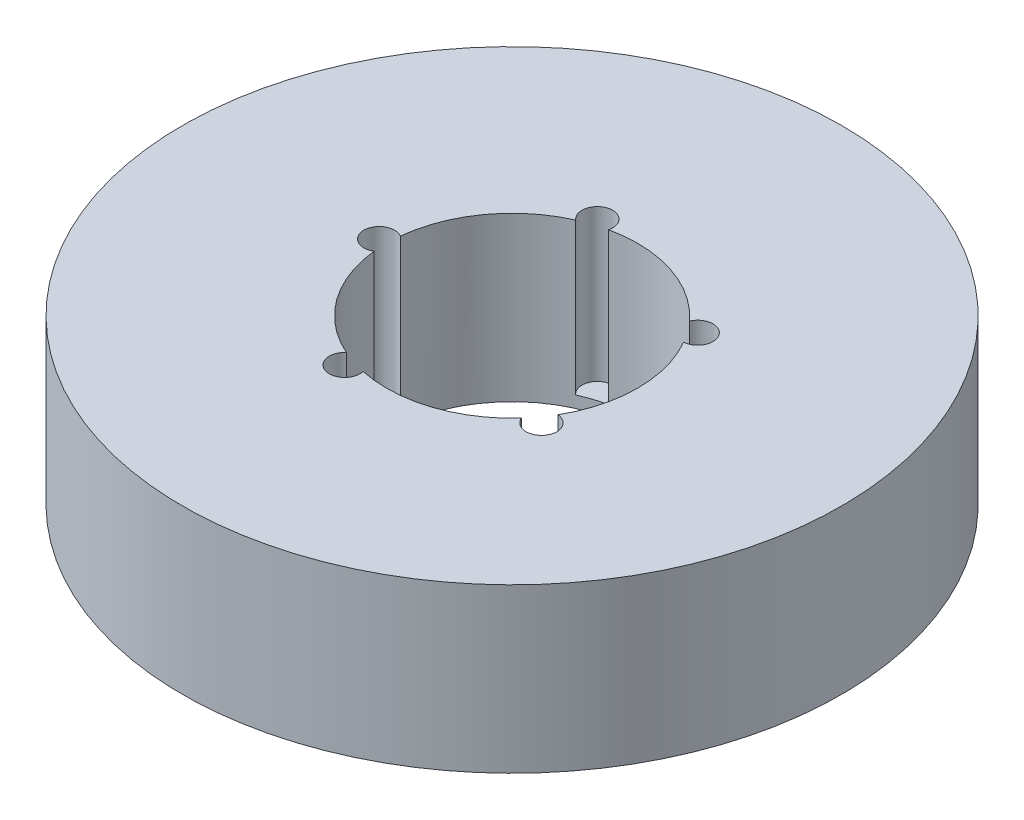
ISO-10303-21;
HEADER;
FILE_DESCRIPTION(('STEP AP214'),'2;1');
FILE_NAME('part.step','',(''),(''),'','','');
FILE_SCHEMA(('AUTOMOTIVE_DESIGN { 1 0 10303 214 1 1 1 1 }'));
ENDSEC;
DATA;
#1=APPLICATION_CONTEXT('core data for automotive mechanical design processes');
#2=APPLICATION_PROTOCOL_DEFINITION('international standard','automotive_design',2000,#1);
#3=PRODUCT_CONTEXT('',#1,'mechanical');
#4=PRODUCT('Part','Part','',(#3));
#5=PRODUCT_RELATED_PRODUCT_CATEGORY('part','',(#4));
#6=PRODUCT_DEFINITION_FORMATION('','',#4);
#7=PRODUCT_DEFINITION_CONTEXT('part definition',#1,'design');
#8=PRODUCT_DEFINITION('design','',#6,#7);
#9=PRODUCT_DEFINITION_SHAPE('','',#8);
#10=(LENGTH_UNIT() NAMED_UNIT(*) SI_UNIT(.MILLI.,.METRE.));
#11=(NAMED_UNIT(*) PLANE_ANGLE_UNIT() SI_UNIT($,.RADIAN.));
#12=(NAMED_UNIT(*) SI_UNIT($,.STERADIAN.) SOLID_ANGLE_UNIT());
#13=UNCERTAINTY_MEASURE_WITH_UNIT(LENGTH_MEASURE(1.E-05),#10,'distance_accuracy_value','');
#14=(GEOMETRIC_REPRESENTATION_CONTEXT(3) GLOBAL_UNCERTAINTY_ASSIGNED_CONTEXT((#13)) GLOBAL_UNIT_ASSIGNED_CONTEXT((#10,
#11,#12)) REPRESENTATION_CONTEXT('',''));
#15=CARTESIAN_POINT('',(0.,0.,0.));
#16=DIRECTION('',(0.,0.,1.));
#17=DIRECTION('',(1.,0.,0.));
#18=AXIS2_PLACEMENT_3D('',#15,#16,#17);
#19=CARTESIAN_POINT('',(0.,26.,0.));
#20=DIRECTION('',(0.,-1.,0.));
#21=DIRECTION('',(0.,0.,-1.));
#22=AXIS2_PLACEMENT_3D('',#19,#20,#21);
#23=CYLINDRICAL_SURFACE('',#22,52.5);
#24=CARTESIAN_POINT('',(0.,26.,0.));
#25=DIRECTION('',(0.,1.,0.));
#26=DIRECTION('',(0.,0.,1.));
#27=AXIS2_PLACEMENT_3D('',#24,#25,#26);
#28=CIRCLE('',#27,52.5);
#29=CARTESIAN_POINT('',(0.,26.,-52.5));
#30=VERTEX_POINT('',#29);
#31=EDGE_CURVE('E160',#30,#30,#28,.T.);
#32=CARTESIAN_POINT('',(0.,0.,0.));
#33=DIRECTION('',(0.,1.,0.));
#34=DIRECTION('',(0.,0.,1.));
#35=AXIS2_PLACEMENT_3D('',#32,#33,#34);
#36=CIRCLE('',#35,52.5);
#37=CARTESIAN_POINT('',(0.,0.,-52.5));
#38=VERTEX_POINT('',#37);
#39=EDGE_CURVE('E153',#38,#38,#36,.T.);
#40=CARTESIAN_POINT('',(0.,26.,-52.5));
#41=CARTESIAN_POINT('',(0.,25.7291666666667,-52.5));
#42=CARTESIAN_POINT('',(0.,25.4583333333333,-52.5));
#43=CARTESIAN_POINT('',(0.,24.9166666666667,-52.5));
#44=CARTESIAN_POINT('',(0.,24.6458333333333,-52.5));
#45=CARTESIAN_POINT('',(0.,24.1041666666667,-52.5));
#46=CARTESIAN_POINT('',(0.,23.8333333333333,-52.5));
#47=CARTESIAN_POINT('',(0.,23.2916666666667,-52.5));
#48=CARTESIAN_POINT('',(0.,23.0208333333333,-52.5));
#49=CARTESIAN_POINT('',(0.,22.4791666666667,-52.5));
#50=CARTESIAN_POINT('',(0.,22.2083333333333,-52.5));
#51=CARTESIAN_POINT('',(0.,21.6666666666667,-52.5));
#52=CARTESIAN_POINT('',(0.,21.3958333333333,-52.5));
#53=CARTESIAN_POINT('',(0.,20.8541666666667,-52.5));
#54=CARTESIAN_POINT('',(0.,20.5833333333333,-52.5));
#55=CARTESIAN_POINT('',(0.,20.0416666666667,-52.5));
#56=CARTESIAN_POINT('',(0.,19.7708333333333,-52.5));
#57=CARTESIAN_POINT('',(0.,19.2291666666667,-52.5));
#58=CARTESIAN_POINT('',(0.,18.9583333333333,-52.5));
#59=CARTESIAN_POINT('',(0.,18.4166666666667,-52.5));
#60=CARTESIAN_POINT('',(0.,18.1458333333333,-52.5));
#61=CARTESIAN_POINT('',(0.,17.6041666666667,-52.5));
#62=CARTESIAN_POINT('',(0.,17.3333333333333,-52.5));
#63=CARTESIAN_POINT('',(0.,16.7916666666667,-52.5));
#64=CARTESIAN_POINT('',(0.,16.5208333333333,-52.5));
#65=CARTESIAN_POINT('',(0.,15.9791666666667,-52.5));
#66=CARTESIAN_POINT('',(0.,15.7083333333333,-52.5));
#67=CARTESIAN_POINT('',(0.,15.1666666666667,-52.5));
#68=CARTESIAN_POINT('',(0.,14.8958333333333,-52.5));
#69=CARTESIAN_POINT('',(0.,14.3541666666667,-52.5));
#70=CARTESIAN_POINT('',(0.,14.0833333333333,-52.5));
#71=CARTESIAN_POINT('',(0.,13.5416666666667,-52.5));
#72=CARTESIAN_POINT('',(0.,13.2708333333333,-52.5));
#73=CARTESIAN_POINT('',(0.,12.7291666666667,-52.5));
#74=CARTESIAN_POINT('',(0.,12.4583333333333,-52.5));
#75=CARTESIAN_POINT('',(0.,11.9166666666667,-52.5));
#76=CARTESIAN_POINT('',(0.,11.6458333333333,-52.5));
#77=CARTESIAN_POINT('',(0.,11.1041666666667,-52.5));
#78=CARTESIAN_POINT('',(0.,10.8333333333333,-52.5));
#79=CARTESIAN_POINT('',(0.,10.2916666666667,-52.5));
#80=CARTESIAN_POINT('',(0.,10.0208333333333,-52.5));
#81=CARTESIAN_POINT('',(0.,9.47916666666667,-52.5));
#82=CARTESIAN_POINT('',(0.,9.20833333333333,-52.5));
#83=CARTESIAN_POINT('',(0.,8.66666666666667,-52.5));
#84=CARTESIAN_POINT('',(0.,8.39583333333333,-52.5));
#85=CARTESIAN_POINT('',(0.,7.85416666666667,-52.5));
#86=CARTESIAN_POINT('',(0.,7.58333333333333,-52.5));
#87=CARTESIAN_POINT('',(0.,7.04166666666667,-52.5));
#88=CARTESIAN_POINT('',(0.,6.77083333333333,-52.5));
#89=CARTESIAN_POINT('',(0.,6.22916666666667,-52.5));
#90=CARTESIAN_POINT('',(0.,5.95833333333333,-52.5));
#91=CARTESIAN_POINT('',(0.,5.41666666666667,-52.5));
#92=CARTESIAN_POINT('',(0.,5.14583333333333,-52.5));
#93=CARTESIAN_POINT('',(0.,4.60416666666667,-52.5));
#94=CARTESIAN_POINT('',(0.,4.33333333333333,-52.5));
#95=CARTESIAN_POINT('',(0.,3.79166666666667,-52.5));
#96=CARTESIAN_POINT('',(0.,3.52083333333333,-52.5));
#97=CARTESIAN_POINT('',(0.,2.97916666666667,-52.5));
#98=CARTESIAN_POINT('',(0.,2.70833333333333,-52.5));
#99=CARTESIAN_POINT('',(0.,2.16666666666667,-52.5));
#100=CARTESIAN_POINT('',(0.,1.89583333333333,-52.5));
#101=CARTESIAN_POINT('',(0.,1.35416666666667,-52.5));
#102=CARTESIAN_POINT('',(0.,1.08333333333333,-52.5));
#103=CARTESIAN_POINT('',(0.,0.541666666666667,-52.5));
#104=CARTESIAN_POINT('',(0.,0.270833333333334,-52.5));
#105=CARTESIAN_POINT('',(0.,0.,-52.5));
#106=B_SPLINE_CURVE_WITH_KNOTS('',3,(#40,#41,#42,#43,#44,#45,#46,#47,#48,#49,#50,#51,#52,#53,
#54,#55,#56,#57,#58,#59,#60,#61,#62,#63,#64,#65,#66,#67,#68,#69,#70,#71,#72,#73,#74,#75,#76,#77,
#78,#79,#80,#81,#82,#83,#84,#85,#86,#87,#88,#89,#90,#91,#92,#93,#94,#95,#96,#97,#98,#99,#100,
#101,#102,#103,#104,#105),.UNSPECIFIED.,.F.,.F.,(4,2,2,2,2,2,2,2,2,2,2,2,2,2,2,2,2,2,2,2,2,2,2,
2,2,2,2,2,2,2,2,2,4),(0.,0.812499999999997,1.625,2.4375,3.25,4.0625,4.875,5.6875,6.5,7.3125,
8.125,8.93749999999999,9.74999999999999,10.5625,11.375,12.1875,13.,13.8125,14.625,15.4375,16.25,
17.0625,17.875,18.6875,19.5,20.3125,21.125,21.9375,22.75,23.5625,24.375,25.1875,26.),.UNSPECIFIED.);
#107=EDGE_CURVE('BSEAM39',#30,#38,#106,.T.);
#108=ORIENTED_EDGE('',*,*,#31,.F.);
#109=ORIENTED_EDGE('',*,*,#39,.T.);
#110=ORIENTED_EDGE('',*,*,#107,.T.);
#111=ORIENTED_EDGE('',*,*,#107,.F.);
#112=EDGE_LOOP('',(#108,#110,#109,#111));
#113=FACE_BOUND('',#112,.T.);
#114=ADVANCED_FACE('F39',(#113),#23,.T.);
#115=CARTESIAN_POINT('',(0.,26.,0.));
#116=DIRECTION('',(0.,1.,0.));
#117=DIRECTION('',(0.,0.,1.));
#118=AXIS2_PLACEMENT_3D('',#115,#116,#117);
#119=PLANE('',#118);
#120=CARTESIAN_POINT('',(-6.5400993430201,26.,20.1283560795039));
#121=DIRECTION('',(0.,1.,0.));
#122=DIRECTION('',(0.951056516295155,0.,0.309016994374945));
#123=AXIS2_PLACEMENT_3D('',#120,#121,#122);
#124=CIRCLE('',#123,2.44404988558101);
#125=CARTESIAN_POINT('',(-8.13068455612735,26.,18.2727110371929));
#126=VERTEX_POINT('',#125);
#127=CARTESIAN_POINT('',(-4.16256808525484,26.,19.5620302355256));
#128=VERTEX_POINT('',#127);
#129=EDGE_CURVE('E186',#126,#128,#124,.T.);
#130=ORIENTED_EDGE('',*,*,#129,.F.);
#131=CARTESIAN_POINT('',(0.,26.,0.));
#132=DIRECTION('',(0.,1.,0.));
#133=DIRECTION('',(0.,0.,1.));
#134=AXIS2_PLACEMENT_3D('',#131,#132,#133);
#135=CIRCLE('',#134,20.);
#136=CARTESIAN_POINT('',(-19.890900606046,26.,2.08616228525006));
#137=VERTEX_POINT('',#136);
#138=EDGE_CURVE('E148',#137,#126,#135,.T.);
#139=ORIENTED_EDGE('',*,*,#138,.F.);
#140=CARTESIAN_POINT('',(-21.1642060536149,26.,0.));
#141=DIRECTION('',(0.,1.,0.));
#142=DIRECTION('',(0.,0.,1.));
#143=AXIS2_PLACEMENT_3D('',#140,#141,#142);
#144=CIRCLE('',#143,2.44404988558101);
#145=CARTESIAN_POINT('',(-19.890900606046,26.,-2.08616228525006));
#146=VERTEX_POINT('',#145);
#147=EDGE_CURVE('E142',#146,#137,#144,.T.);
#148=ORIENTED_EDGE('',*,*,#147,.F.);
#149=CARTESIAN_POINT('',(-8.13068455612761,26.,-18.2727110371928));
#150=VERTEX_POINT('',#149);
#151=EDGE_CURVE('E132',#150,#146,#135,.T.);
#152=ORIENTED_EDGE('',*,*,#151,.F.);
#153=CARTESIAN_POINT('',(-6.54009934302039,26.,-20.1283560795038));
#154=DIRECTION('',(0.,1.,0.));
#155=DIRECTION('',(-0.95105651629515,0.,0.309016994374958));
#156=AXIS2_PLACEMENT_3D('',#153,#154,#155);
#157=CIRCLE('',#156,2.44404988558101);
#158=CARTESIAN_POINT('',(-4.16256808525511,26.,-19.5620302355255));
#159=VERTEX_POINT('',#158);
#160=EDGE_CURVE('E111',#159,#150,#157,.T.);
#161=ORIENTED_EDGE('',*,*,#160,.F.);
#162=CARTESIAN_POINT('',(14.8658611985553,26.,-13.3793187728407));
#163=VERTEX_POINT('',#162);
#164=EDGE_CURVE('E141',#163,#159,#135,.T.);
#165=ORIENTED_EDGE('',*,*,#164,.F.);
#166=CARTESIAN_POINT('',(17.1222023698275,26.,-12.4400081947941));
#167=DIRECTION('',(0.,1.,0.));
#168=DIRECTION('',(-0.58778525229248,0.,-0.809016994374942));
#169=AXIS2_PLACEMENT_3D('',#166,#167,#168);
#170=CIRCLE('',#169,2.44404988558101);
#171=CARTESIAN_POINT('',(17.3182920488728,26.,-10.003837289258));
#172=VERTEX_POINT('',#171);
#173=EDGE_CURVE('E173',#172,#163,#170,.T.);
#174=ORIENTED_EDGE('',*,*,#173,.F.);
#175=CARTESIAN_POINT('',(17.3182920488729,26.,10.0038372892578));
#176=VERTEX_POINT('',#175);
#177=EDGE_CURVE('E150',#176,#172,#135,.T.);
#178=ORIENTED_EDGE('',*,*,#177,.F.);
#179=CARTESIAN_POINT('',(17.1222023698277,26.,12.4400081947939));
#180=DIRECTION('',(0.,1.,0.));
#181=DIRECTION('',(0.587785252292469,0.,-0.809016994374951));
#182=AXIS2_PLACEMENT_3D('',#179,#180,#181);
#183=CIRCLE('',#182,2.44404988558101);
#184=CARTESIAN_POINT('',(14.8658611985555,26.,13.3793187728405));
#185=VERTEX_POINT('',#184);
#186=EDGE_CURVE('E172',#185,#176,#183,.T.);
#187=ORIENTED_EDGE('',*,*,#186,.F.);
#188=EDGE_CURVE('E152',#128,#185,#135,.T.);
#189=ORIENTED_EDGE('',*,*,#188,.F.);
#190=EDGE_LOOP('',(#130,#139,#148,#152,#161,#165,#174,#178,#187,#189));
#191=FACE_BOUND('',#190,.T.);
#192=ORIENTED_EDGE('',*,*,#31,.T.);
#193=EDGE_LOOP('',(#192));
#194=FACE_BOUND('',#193,.T.);
#195=ADVANCED_FACE('F138',(#191,#194),#119,.T.);
#196=CARTESIAN_POINT('',(0.,0.,0.));
#197=DIRECTION('',(0.,1.,0.));
#198=DIRECTION('',(0.,0.,1.));
#199=AXIS2_PLACEMENT_3D('',#196,#197,#198);
#200=PLANE('',#199);
#201=CARTESIAN_POINT('',(0.,0.,0.));
#202=DIRECTION('',(0.,1.,0.));
#203=DIRECTION('',(0.,0.,1.));
#204=AXIS2_PLACEMENT_3D('',#201,#202,#203);
#205=CIRCLE('',#204,20.);
#206=CARTESIAN_POINT('',(0.,0.,20.));
#207=VERTEX_POINT('',#206);
#208=EDGE_CURVE('E145',#207,#207,#205,.T.);
#209=ORIENTED_EDGE('',*,*,#208,.T.);
#210=EDGE_LOOP('',(#209));
#211=FACE_BOUND('',#210,.T.);
#212=ORIENTED_EDGE('',*,*,#39,.F.);
#213=EDGE_LOOP('',(#212));
#214=FACE_BOUND('',#213,.T.);
#215=ADVANCED_FACE('F216',(#211,#214),#200,.F.);
#216=CARTESIAN_POINT('',(0.,26.,0.));
#217=DIRECTION('',(0.,-1.,0.));
#218=DIRECTION('',(0.,0.,-1.));
#219=AXIS2_PLACEMENT_3D('',#216,#217,#218);
#220=CYLINDRICAL_SURFACE('',#219,20.);
#221=DIRECTION('',(0.,1.,0.));
#222=VECTOR('',#221,1.);
#223=CARTESIAN_POINT('',(-8.13068455612735,13.9364182433374,18.2727110371929));
#224=LINE('',#223,#222);
#225=CARTESIAN_POINT('',(-8.13068455612735,1.87283648667476,18.2727110371929));
#226=VERTEX_POINT('',#225);
#227=EDGE_CURVE('E11',#226,#126,#224,.T.);
#228=ORIENTED_EDGE('',*,*,#227,.F.);
#229=CARTESIAN_POINT('',(0.,1.87283648667476,0.));
#230=DIRECTION('',(0.,1.,0.));
#231=DIRECTION('',(0.,0.,1.));
#232=AXIS2_PLACEMENT_3D('',#229,#230,#231);
#233=CIRCLE('',#232,20.);
#234=CARTESIAN_POINT('',(-4.16256808525484,1.87283648667476,19.5620302355256));
#235=VERTEX_POINT('',#234);
#236=EDGE_CURVE('E192',#226,#235,#233,.T.);
#237=ORIENTED_EDGE('',*,*,#236,.T.);
#238=DIRECTION('',(0.,1.,0.));
#239=VECTOR('',#238,1.);
#240=CARTESIAN_POINT('',(-4.16256808525484,13.9364182433374,19.5620302355256));
#241=LINE('',#240,#239);
#242=EDGE_CURVE('E46',#128,#235,#241,.F.);
#243=ORIENTED_EDGE('',*,*,#242,.F.);
#244=ORIENTED_EDGE('',*,*,#188,.T.);
#245=DIRECTION('',(0.,1.,0.));
#246=VECTOR('',#245,1.);
#247=CARTESIAN_POINT('',(14.8658611985555,13.9364182433374,13.3793187728405));
#248=LINE('',#247,#246);
#249=CARTESIAN_POINT('',(14.8658611985555,1.87283648667476,13.3793187728405));
#250=VERTEX_POINT('',#249);
#251=EDGE_CURVE('E195',#250,#185,#248,.T.);
#252=ORIENTED_EDGE('',*,*,#251,.F.);
#253=CARTESIAN_POINT('',(0.,1.87283648667476,0.));
#254=DIRECTION('',(0.,1.,0.));
#255=DIRECTION('',(0.,0.,1.));
#256=AXIS2_PLACEMENT_3D('',#253,#254,#255);
#257=CIRCLE('',#256,20.);
#258=CARTESIAN_POINT('',(17.3182920488729,1.87283648667476,10.0038372892578));
#259=VERTEX_POINT('',#258);
#260=EDGE_CURVE('E197',#250,#259,#257,.T.);
#261=ORIENTED_EDGE('',*,*,#260,.T.);
#262=DIRECTION('',(0.,1.,0.));
#263=VECTOR('',#262,1.);
#264=CARTESIAN_POINT('',(17.318292048873,13.9364182433374,10.0038372892578));
#265=LINE('',#264,#263);
#266=EDGE_CURVE('E168',#176,#259,#265,.F.);
#267=ORIENTED_EDGE('',*,*,#266,.F.);
#268=ORIENTED_EDGE('',*,*,#177,.T.);
#269=DIRECTION('',(0.,1.,0.));
#270=VECTOR('',#269,1.);
#271=CARTESIAN_POINT('',(17.3182920488728,13.9364182433374,-10.003837289258));
#272=LINE('',#271,#270);
#273=CARTESIAN_POINT('',(17.3182920488728,1.87283648667476,-10.003837289258));
#274=VERTEX_POINT('',#273);
#275=EDGE_CURVE('E169',#274,#172,#272,.T.);
#276=ORIENTED_EDGE('',*,*,#275,.F.);
#277=CARTESIAN_POINT('',(0.,1.87283648667476,0.));
#278=DIRECTION('',(0.,1.,0.));
#279=DIRECTION('',(0.,0.,1.));
#280=AXIS2_PLACEMENT_3D('',#277,#278,#279);
#281=CIRCLE('',#280,20.);
#282=CARTESIAN_POINT('',(14.8658611985553,1.87283648667476,-13.3793187728407));
#283=VERTEX_POINT('',#282);
#284=EDGE_CURVE('E332',#274,#283,#281,.T.);
#285=ORIENTED_EDGE('',*,*,#284,.T.);
#286=DIRECTION('',(0.,1.,0.));
#287=VECTOR('',#286,1.);
#288=CARTESIAN_POINT('',(14.8658611985553,13.9364182433374,-13.3793187728408));
#289=LINE('',#288,#287);
#290=EDGE_CURVE('E335',#163,#283,#289,.F.);
#291=ORIENTED_EDGE('',*,*,#290,.F.);
#292=ORIENTED_EDGE('',*,*,#164,.T.);
#293=DIRECTION('',(0.,1.,0.));
#294=VECTOR('',#293,1.);
#295=CARTESIAN_POINT('',(-4.16256808525511,13.9364182433374,-19.5620302355256));
#296=LINE('',#295,#294);
#297=CARTESIAN_POINT('',(-4.16256808525511,1.87283648667476,-19.5620302355255));
#298=VERTEX_POINT('',#297);
#299=EDGE_CURVE('E121',#298,#159,#296,.T.);
#300=ORIENTED_EDGE('',*,*,#299,.F.);
#301=CARTESIAN_POINT('',(0.,1.87283648667476,0.));
#302=DIRECTION('',(0.,1.,0.));
#303=DIRECTION('',(0.,0.,1.));
#304=AXIS2_PLACEMENT_3D('',#301,#302,#303);
#305=CIRCLE('',#304,20.);
#306=CARTESIAN_POINT('',(-8.13068455612761,1.87283648667476,-18.2727110371928));
#307=VERTEX_POINT('',#306);
#308=EDGE_CURVE('E134',#298,#307,#305,.T.);
#309=ORIENTED_EDGE('',*,*,#308,.T.);
#310=DIRECTION('',(0.,1.,0.));
#311=VECTOR('',#310,1.);
#312=CARTESIAN_POINT('',(-8.13068455612762,13.9364182433374,-18.2727110371928));
#313=LINE('',#312,#311);
#314=EDGE_CURVE('E117',#150,#307,#313,.F.);
#315=ORIENTED_EDGE('',*,*,#314,.F.);
#316=ORIENTED_EDGE('',*,*,#151,.T.);
#317=DIRECTION('',(0.,1.,0.));
#318=VECTOR('',#317,1.);
#319=CARTESIAN_POINT('',(-19.890900606046,13.9364182433374,-2.08616228525006));
#320=LINE('',#319,#318);
#321=CARTESIAN_POINT('',(-19.890900606046,1.87283648667476,-2.08616228525006));
#322=VERTEX_POINT('',#321);
#323=EDGE_CURVE('E338',#322,#146,#320,.T.);
#324=ORIENTED_EDGE('',*,*,#323,.F.);
#325=CARTESIAN_POINT('',(0.,1.87283648667476,0.));
#326=DIRECTION('',(0.,1.,0.));
#327=DIRECTION('',(0.,0.,1.));
#328=AXIS2_PLACEMENT_3D('',#325,#326,#327);
#329=CIRCLE('',#328,20.);
#330=CARTESIAN_POINT('',(-19.890900606046,1.87283648667476,2.08616228525006));
#331=VERTEX_POINT('',#330);
#332=EDGE_CURVE('E342',#322,#331,#329,.T.);
#333=ORIENTED_EDGE('',*,*,#332,.T.);
#334=DIRECTION('',(0.,1.,0.));
#335=VECTOR('',#334,1.);
#336=CARTESIAN_POINT('',(-19.890900606046,13.9364182433374,2.08616228525006));
#337=LINE('',#336,#335);
#338=EDGE_CURVE('E341',#137,#331,#337,.F.);
#339=ORIENTED_EDGE('',*,*,#338,.F.);
#340=ORIENTED_EDGE('',*,*,#138,.T.);
#341=EDGE_LOOP('',(#228,#237,#243,#244,#252,#261,#267,#268,#276,#285,#291,#292,#300,#309,#315,
#316,#324,#333,#339,#340));
#342=FACE_BOUND('',#341,.T.);
#343=ORIENTED_EDGE('',*,*,#208,.F.);
#344=EDGE_LOOP('',(#343));
#345=FACE_BOUND('',#344,.T.);
#346=ADVANCED_FACE('F128',(#342,#345),#220,.F.);
#347=CARTESIAN_POINT('',(-21.1642060536149,1.87283648667476,0.));
#348=DIRECTION('',(0.,1.,0.));
#349=DIRECTION('',(0.,0.,1.));
#350=AXIS2_PLACEMENT_3D('',#347,#348,#349);
#351=CYLINDRICAL_SURFACE('',#350,2.44404988558101);
#352=ORIENTED_EDGE('',*,*,#323,.T.);
#353=ORIENTED_EDGE('',*,*,#147,.T.);
#354=ORIENTED_EDGE('',*,*,#338,.T.);
#355=CARTESIAN_POINT('',(-21.1642060536149,1.87283648667476,0.));
#356=DIRECTION('',(0.,1.,0.));
#357=DIRECTION('',(0.,0.,1.));
#358=AXIS2_PLACEMENT_3D('',#355,#356,#357);
#359=CIRCLE('',#358,2.44404988558101);
#360=EDGE_CURVE('E149',#322,#331,#359,.T.);
#361=ORIENTED_EDGE('',*,*,#360,.F.);
#362=EDGE_LOOP('',(#352,#353,#354,#361));
#363=FACE_BOUND('',#362,.T.);
#364=ADVANCED_FACE('F227',(#363),#351,.F.);
#365=CARTESIAN_POINT('',(-21.1642060536149,1.87283648667476,0.));
#366=DIRECTION('',(0.,1.,0.));
#367=DIRECTION('',(0.,0.,1.));
#368=AXIS2_PLACEMENT_3D('',#365,#366,#367);
#369=PLANE('',#368);
#370=ORIENTED_EDGE('',*,*,#360,.T.);
#371=ORIENTED_EDGE('',*,*,#332,.F.);
#372=EDGE_LOOP('',(#370,#371));
#373=FACE_BOUND('',#372,.T.);
#374=ADVANCED_FACE('F235',(#373),#369,.T.);
#375=CARTESIAN_POINT('',(-6.54009934302039,1.87283648667476,-20.1283560795038));
#376=DIRECTION('',(0.,1.,0.));
#377=DIRECTION('',(0.,0.,1.));
#378=AXIS2_PLACEMENT_3D('',#375,#376,#377);
#379=CYLINDRICAL_SURFACE('',#378,2.44404988558101);
#380=ORIENTED_EDGE('',*,*,#299,.T.);
#381=ORIENTED_EDGE('',*,*,#160,.T.);
#382=ORIENTED_EDGE('',*,*,#314,.T.);
#383=CARTESIAN_POINT('',(-6.54009934302039,1.87283648667476,-20.1283560795038));
#384=DIRECTION('',(0.,1.,0.));
#385=DIRECTION('',(-0.95105651629515,0.,0.309016994374958));
#386=AXIS2_PLACEMENT_3D('',#383,#384,#385);
#387=CIRCLE('',#386,2.44404988558101);
#388=EDGE_CURVE('E127',#298,#307,#387,.T.);
#389=ORIENTED_EDGE('',*,*,#388,.F.);
#390=EDGE_LOOP('',(#380,#381,#382,#389));
#391=FACE_BOUND('',#390,.T.);
#392=ADVANCED_FACE('F116',(#391),#379,.F.);
#393=CARTESIAN_POINT('',(-6.54009934302039,1.87283648667476,-20.1283560795038));
#394=DIRECTION('',(0.,1.,0.));
#395=DIRECTION('',(-0.95105651629515,0.,0.309016994374958));
#396=AXIS2_PLACEMENT_3D('',#393,#394,#395);
#397=PLANE('',#396);
#398=ORIENTED_EDGE('',*,*,#388,.T.);
#399=ORIENTED_EDGE('',*,*,#308,.F.);
#400=EDGE_LOOP('',(#398,#399));
#401=FACE_BOUND('',#400,.T.);
#402=ADVANCED_FACE('F236',(#401),#397,.T.);
#403=CARTESIAN_POINT('',(17.1222023698275,1.87283648667476,-12.4400081947941));
#404=DIRECTION('',(0.,1.,0.));
#405=DIRECTION('',(0.,0.,1.));
#406=AXIS2_PLACEMENT_3D('',#403,#404,#405);
#407=CYLINDRICAL_SURFACE('',#406,2.44404988558101);
#408=ORIENTED_EDGE('',*,*,#275,.T.);
#409=ORIENTED_EDGE('',*,*,#173,.T.);
#410=ORIENTED_EDGE('',*,*,#290,.T.);
#411=CARTESIAN_POINT('',(17.1222023698275,1.87283648667476,-12.4400081947941));
#412=DIRECTION('',(0.,1.,0.));
#413=DIRECTION('',(-0.58778525229248,0.,-0.809016994374942));
#414=AXIS2_PLACEMENT_3D('',#411,#412,#413);
#415=CIRCLE('',#414,2.44404988558101);
#416=EDGE_CURVE('E177',#274,#283,#415,.T.);
#417=ORIENTED_EDGE('',*,*,#416,.F.);
#418=EDGE_LOOP('',(#408,#409,#410,#417));
#419=FACE_BOUND('',#418,.T.);
#420=ADVANCED_FACE('F241',(#419),#407,.F.);
#421=CARTESIAN_POINT('',(17.1222023698275,1.87283648667476,-12.4400081947941));
#422=DIRECTION('',(0.,1.,0.));
#423=DIRECTION('',(-0.58778525229248,0.,-0.809016994374942));
#424=AXIS2_PLACEMENT_3D('',#421,#422,#423);
#425=PLANE('',#424);
#426=ORIENTED_EDGE('',*,*,#416,.T.);
#427=ORIENTED_EDGE('',*,*,#284,.F.);
#428=EDGE_LOOP('',(#426,#427));
#429=FACE_BOUND('',#428,.T.);
#430=ADVANCED_FACE('F244',(#429),#425,.T.);
#431=CARTESIAN_POINT('',(17.1222023698277,1.87283648667476,12.4400081947939));
#432=DIRECTION('',(0.,1.,0.));
#433=DIRECTION('',(0.,0.,1.));
#434=AXIS2_PLACEMENT_3D('',#431,#432,#433);
#435=CYLINDRICAL_SURFACE('',#434,2.44404988558101);
#436=ORIENTED_EDGE('',*,*,#251,.T.);
#437=ORIENTED_EDGE('',*,*,#186,.T.);
#438=ORIENTED_EDGE('',*,*,#266,.T.);
#439=CARTESIAN_POINT('',(17.1222023698277,1.87283648667476,12.4400081947939));
#440=DIRECTION('',(0.,1.,0.));
#441=DIRECTION('',(0.587785252292469,0.,-0.809016994374951));
#442=AXIS2_PLACEMENT_3D('',#439,#440,#441);
#443=CIRCLE('',#442,2.44404988558101);
#444=EDGE_CURVE('E56',#250,#259,#443,.T.);
#445=ORIENTED_EDGE('',*,*,#444,.F.);
#446=EDGE_LOOP('',(#436,#437,#438,#445));
#447=FACE_BOUND('',#446,.T.);
#448=ADVANCED_FACE('F191',(#447),#435,.F.);
#449=CARTESIAN_POINT('',(17.1222023698277,1.87283648667476,12.4400081947939));
#450=DIRECTION('',(0.,1.,0.));
#451=DIRECTION('',(0.587785252292469,0.,-0.809016994374951));
#452=AXIS2_PLACEMENT_3D('',#449,#450,#451);
#453=PLANE('',#452);
#454=ORIENTED_EDGE('',*,*,#444,.T.);
#455=ORIENTED_EDGE('',*,*,#260,.F.);
#456=EDGE_LOOP('',(#454,#455));
#457=FACE_BOUND('',#456,.T.);
#458=ADVANCED_FACE('F208',(#457),#453,.T.);
#459=CARTESIAN_POINT('',(-6.5400993430201,1.87283648667476,20.1283560795039));
#460=DIRECTION('',(0.,1.,0.));
#461=DIRECTION('',(0.,0.,1.));
#462=AXIS2_PLACEMENT_3D('',#459,#460,#461);
#463=CYLINDRICAL_SURFACE('',#462,2.44404988558101);
#464=ORIENTED_EDGE('',*,*,#227,.T.);
#465=ORIENTED_EDGE('',*,*,#129,.T.);
#466=ORIENTED_EDGE('',*,*,#242,.T.);
#467=CARTESIAN_POINT('',(-6.5400993430201,1.87283648667476,20.1283560795039));
#468=DIRECTION('',(0.,1.,0.));
#469=DIRECTION('',(0.951056516295155,0.,0.309016994374945));
#470=AXIS2_PLACEMENT_3D('',#467,#468,#469);
#471=CIRCLE('',#470,2.44404988558101);
#472=EDGE_CURVE('E55',#226,#235,#471,.T.);
#473=ORIENTED_EDGE('',*,*,#472,.F.);
#474=EDGE_LOOP('',(#464,#465,#466,#473));
#475=FACE_BOUND('',#474,.T.);
#476=ADVANCED_FACE('F203',(#475),#463,.F.);
#477=CARTESIAN_POINT('',(-6.5400993430201,1.87283648667476,20.1283560795039));
#478=DIRECTION('',(0.,1.,0.));
#479=DIRECTION('',(0.951056516295155,0.,0.309016994374945));
#480=AXIS2_PLACEMENT_3D('',#477,#478,#479);
#481=PLANE('',#480);
#482=ORIENTED_EDGE('',*,*,#472,.T.);
#483=ORIENTED_EDGE('',*,*,#236,.F.);
#484=EDGE_LOOP('',(#482,#483));
#485=FACE_BOUND('',#484,.T.);
#486=ADVANCED_FACE('F205',(#485),#481,.T.);
#487=CLOSED_SHELL('',(#114,#195,#215,#346,#364,#374,#392,#402,#420,#430,#448,#458,#476,#486));
#488=MANIFOLD_SOLID_BREP('B2',#487);
#489=ADVANCED_BREP_SHAPE_REPRESENTATION('',(#18,#488),#14);
#490=SHAPE_DEFINITION_REPRESENTATION(#9,#489);
ENDSEC;
END-ISO-10303-21;
